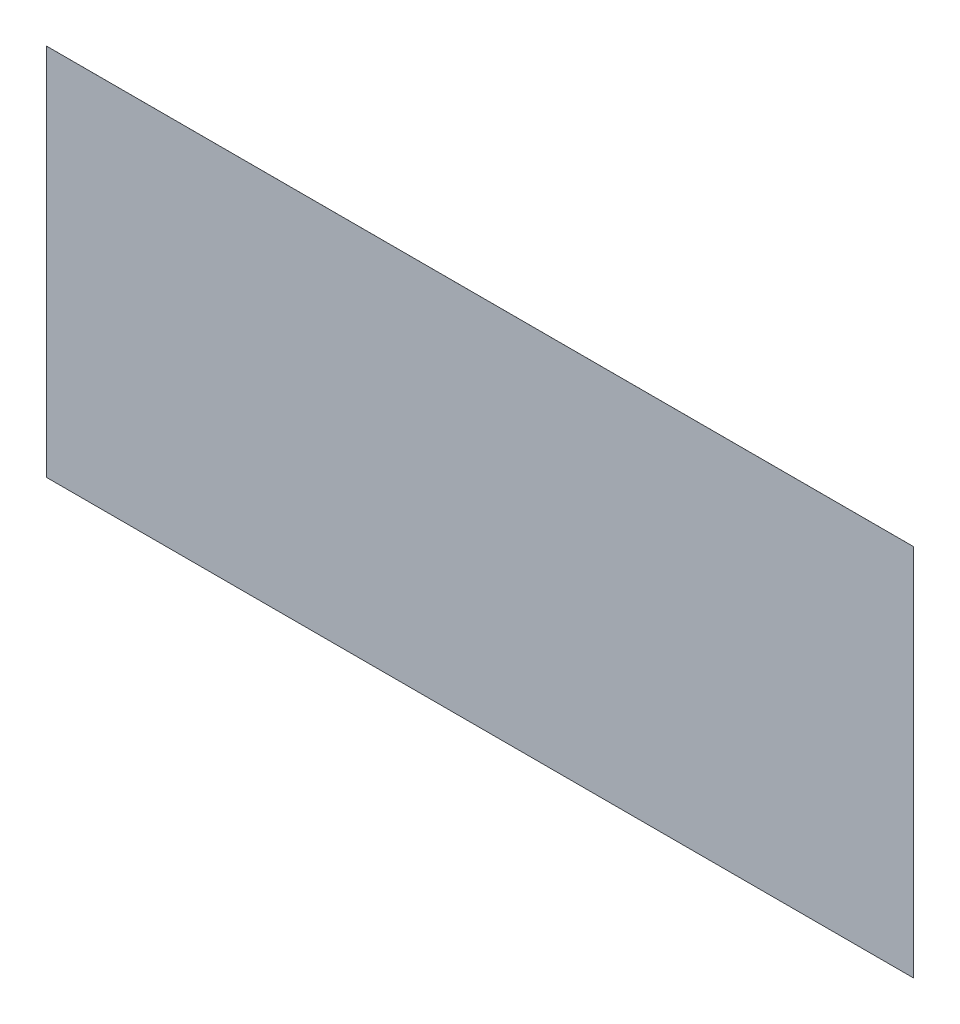
ISO-10303-21;
HEADER;
FILE_DESCRIPTION(('STEP AP214'),'2;1');
FILE_NAME('part.step','',(''),(''),'','','');
FILE_SCHEMA(('AUTOMOTIVE_DESIGN { 1 0 10303 214 1 1 1 1 }'));
ENDSEC;
DATA;
#1=APPLICATION_CONTEXT('core data for automotive mechanical design processes');
#2=APPLICATION_PROTOCOL_DEFINITION('international standard','automotive_design',2000,#1);
#3=PRODUCT_CONTEXT('',#1,'mechanical');
#4=PRODUCT('Part','Part','',(#3));
#5=PRODUCT_RELATED_PRODUCT_CATEGORY('part','',(#4));
#6=PRODUCT_DEFINITION_FORMATION('','',#4);
#7=PRODUCT_DEFINITION_CONTEXT('part definition',#1,'design');
#8=PRODUCT_DEFINITION('design','',#6,#7);
#9=PRODUCT_DEFINITION_SHAPE('','',#8);
#10=(LENGTH_UNIT() NAMED_UNIT(*) SI_UNIT(.MILLI.,.METRE.));
#11=(NAMED_UNIT(*) PLANE_ANGLE_UNIT() SI_UNIT($,.RADIAN.));
#12=(NAMED_UNIT(*) SI_UNIT($,.STERADIAN.) SOLID_ANGLE_UNIT());
#13=UNCERTAINTY_MEASURE_WITH_UNIT(LENGTH_MEASURE(1.E-05),#10,'distance_accuracy_value','');
#14=(GEOMETRIC_REPRESENTATION_CONTEXT(3) GLOBAL_UNCERTAINTY_ASSIGNED_CONTEXT((#13)) GLOBAL_UNIT_ASSIGNED_CONTEXT((#10,
#11,#12)) REPRESENTATION_CONTEXT('',''));
#15=CARTESIAN_POINT('',(0.,0.,0.));
#16=DIRECTION('',(0.,0.,1.));
#17=DIRECTION('',(1.,0.,0.));
#18=AXIS2_PLACEMENT_3D('',#15,#16,#17);
#19=CARTESIAN_POINT('',(-5.06,1.885,0.00025));
#20=DIRECTION('',(1.,0.,0.));
#21=DIRECTION('',(0.,0.,-1.));
#22=AXIS2_PLACEMENT_3D('',#19,#20,#21);
#23=PLANE('',#22);
#24=DIRECTION('',(0.,-1.,0.));
#25=VECTOR('',#24,1.);
#26=CARTESIAN_POINT('',(-5.06,1.885,0.));
#27=LINE('',#26,#25);
#28=CARTESIAN_POINT('',(-5.06,1.885,0.));
#29=VERTEX_POINT('',#28);
#30=CARTESIAN_POINT('',(-5.06,-2.475,0.));
#31=VERTEX_POINT('',#30);
#32=EDGE_CURVE('E111',#29,#31,#27,.T.);
#33=ORIENTED_EDGE('',*,*,#32,.T.);
#34=DIRECTION('',(0.,0.,-1.));
#35=VECTOR('',#34,1.);
#36=CARTESIAN_POINT('',(-5.06,-2.475,0.00025));
#37=LINE('',#36,#35);
#38=CARTESIAN_POINT('',(-5.06,-2.475,0.00025));
#39=VERTEX_POINT('',#38);
#40=EDGE_CURVE('E11',#39,#31,#37,.T.);
#41=ORIENTED_EDGE('',*,*,#40,.F.);
#42=DIRECTION('',(0.,-1.,0.));
#43=VECTOR('',#42,1.);
#44=CARTESIAN_POINT('',(-5.06,1.885,0.00025));
#45=LINE('',#44,#43);
#46=CARTESIAN_POINT('',(-5.06,1.885,0.00025));
#47=VERTEX_POINT('',#46);
#48=EDGE_CURVE('E95',#47,#39,#45,.T.);
#49=ORIENTED_EDGE('',*,*,#48,.F.);
#50=DIRECTION('',(0.,0.,-1.));
#51=VECTOR('',#50,1.);
#52=CARTESIAN_POINT('',(-5.06,1.885,0.00025));
#53=LINE('',#52,#51);
#54=EDGE_CURVE('E107',#47,#29,#53,.T.);
#55=ORIENTED_EDGE('',*,*,#54,.T.);
#56=EDGE_LOOP('',(#33,#41,#49,#55));
#57=FACE_BOUND('',#56,.T.);
#58=ADVANCED_FACE('F43',(#57),#23,.F.);
#59=CARTESIAN_POINT('',(-5.06,-2.475,0.00025));
#60=DIRECTION('',(0.,1.,0.));
#61=DIRECTION('',(0.,0.,1.));
#62=AXIS2_PLACEMENT_3D('',#59,#60,#61);
#63=PLANE('',#62);
#64=DIRECTION('',(1.,0.,0.));
#65=VECTOR('',#64,1.);
#66=CARTESIAN_POINT('',(-5.06,-2.475,0.));
#67=LINE('',#66,#65);
#68=CARTESIAN_POINT('',(5.06,-2.475,0.));
#69=VERTEX_POINT('',#68);
#70=EDGE_CURVE('E100',#31,#69,#67,.T.);
#71=ORIENTED_EDGE('',*,*,#70,.T.);
#72=DIRECTION('',(0.,0.,-1.));
#73=VECTOR('',#72,1.);
#74=CARTESIAN_POINT('',(5.06,-2.475,0.00025));
#75=LINE('',#74,#73);
#76=CARTESIAN_POINT('',(5.06,-2.475,0.00025));
#77=VERTEX_POINT('',#76);
#78=EDGE_CURVE('E52',#77,#69,#75,.T.);
#79=ORIENTED_EDGE('',*,*,#78,.F.);
#80=DIRECTION('',(1.,0.,0.));
#81=VECTOR('',#80,1.);
#82=CARTESIAN_POINT('',(-5.06,-2.475,0.00025));
#83=LINE('',#82,#81);
#84=EDGE_CURVE('E90',#39,#77,#83,.T.);
#85=ORIENTED_EDGE('',*,*,#84,.F.);
#86=ORIENTED_EDGE('',*,*,#40,.T.);
#87=EDGE_LOOP('',(#71,#79,#85,#86));
#88=FACE_BOUND('',#87,.T.);
#89=ADVANCED_FACE('F99',(#88),#63,.F.);
#90=CARTESIAN_POINT('',(5.06,-2.475,0.00025));
#91=DIRECTION('',(-1.,0.,0.));
#92=DIRECTION('',(0.,0.,1.));
#93=AXIS2_PLACEMENT_3D('',#90,#91,#92);
#94=PLANE('',#93);
#95=DIRECTION('',(0.,1.,0.));
#96=VECTOR('',#95,1.);
#97=CARTESIAN_POINT('',(5.06,-2.475,0.));
#98=LINE('',#97,#96);
#99=CARTESIAN_POINT('',(5.06,1.885,0.));
#100=VERTEX_POINT('',#99);
#101=EDGE_CURVE('E77',#69,#100,#98,.T.);
#102=ORIENTED_EDGE('',*,*,#101,.T.);
#103=DIRECTION('',(0.,0.,-1.));
#104=VECTOR('',#103,1.);
#105=CARTESIAN_POINT('',(5.06,1.885,0.00025));
#106=LINE('',#105,#104);
#107=CARTESIAN_POINT('',(5.06,1.885,0.00025));
#108=VERTEX_POINT('',#107);
#109=EDGE_CURVE('E102',#108,#100,#106,.T.);
#110=ORIENTED_EDGE('',*,*,#109,.F.);
#111=DIRECTION('',(0.,1.,0.));
#112=VECTOR('',#111,1.);
#113=CARTESIAN_POINT('',(5.06,-2.475,0.00025));
#114=LINE('',#113,#112);
#115=EDGE_CURVE('E93',#77,#108,#114,.T.);
#116=ORIENTED_EDGE('',*,*,#115,.F.);
#117=ORIENTED_EDGE('',*,*,#78,.T.);
#118=EDGE_LOOP('',(#102,#110,#116,#117));
#119=FACE_BOUND('',#118,.T.);
#120=ADVANCED_FACE('F103',(#119),#94,.F.);
#121=CARTESIAN_POINT('',(5.06,1.885,0.00025));
#122=DIRECTION('',(0.,-1.,0.));
#123=DIRECTION('',(0.,0.,-1.));
#124=AXIS2_PLACEMENT_3D('',#121,#122,#123);
#125=PLANE('',#124);
#126=DIRECTION('',(-1.,0.,0.));
#127=VECTOR('',#126,1.);
#128=CARTESIAN_POINT('',(5.06,1.885,0.));
#129=LINE('',#128,#127);
#130=EDGE_CURVE('E83',#100,#29,#129,.T.);
#131=ORIENTED_EDGE('',*,*,#130,.T.);
#132=ORIENTED_EDGE('',*,*,#54,.F.);
#133=DIRECTION('',(-1.,0.,0.));
#134=VECTOR('',#133,1.);
#135=CARTESIAN_POINT('',(5.06,1.885,0.00025));
#136=LINE('',#135,#134);
#137=EDGE_CURVE('E60',#108,#47,#136,.T.);
#138=ORIENTED_EDGE('',*,*,#137,.F.);
#139=ORIENTED_EDGE('',*,*,#109,.T.);
#140=EDGE_LOOP('',(#131,#132,#138,#139));
#141=FACE_BOUND('',#140,.T.);
#142=ADVANCED_FACE('F124',(#141),#125,.F.);
#143=CARTESIAN_POINT('',(0.,0.,0.00025));
#144=DIRECTION('',(0.,0.,1.));
#145=DIRECTION('',(1.,0.,0.));
#146=AXIS2_PLACEMENT_3D('',#143,#144,#145);
#147=PLANE('',#146);
#148=ORIENTED_EDGE('',*,*,#48,.T.);
#149=ORIENTED_EDGE('',*,*,#84,.T.);
#150=ORIENTED_EDGE('',*,*,#115,.T.);
#151=ORIENTED_EDGE('',*,*,#137,.T.);
#152=EDGE_LOOP('',(#148,#149,#150,#151));
#153=FACE_BOUND('',#152,.T.);
#154=ADVANCED_FACE('F91',(#153),#147,.T.);
#155=CARTESIAN_POINT('',(0.,0.,0.));
#156=DIRECTION('',(0.,0.,1.));
#157=DIRECTION('',(1.,0.,0.));
#158=AXIS2_PLACEMENT_3D('',#155,#156,#157);
#159=PLANE('',#158);
#160=ORIENTED_EDGE('',*,*,#32,.F.);
#161=ORIENTED_EDGE('',*,*,#130,.F.);
#162=ORIENTED_EDGE('',*,*,#101,.F.);
#163=ORIENTED_EDGE('',*,*,#70,.F.);
#164=EDGE_LOOP('',(#160,#161,#162,#163));
#165=FACE_BOUND('',#164,.T.);
#166=ADVANCED_FACE('F127',(#165),#159,.F.);
#167=CLOSED_SHELL('',(#58,#89,#120,#142,#154,#166));
#168=MANIFOLD_SOLID_BREP('B2',#167);
#169=ADVANCED_BREP_SHAPE_REPRESENTATION('',(#18,#168),#14);
#170=SHAPE_DEFINITION_REPRESENTATION(#9,#169);
ENDSEC;
END-ISO-10303-21;
